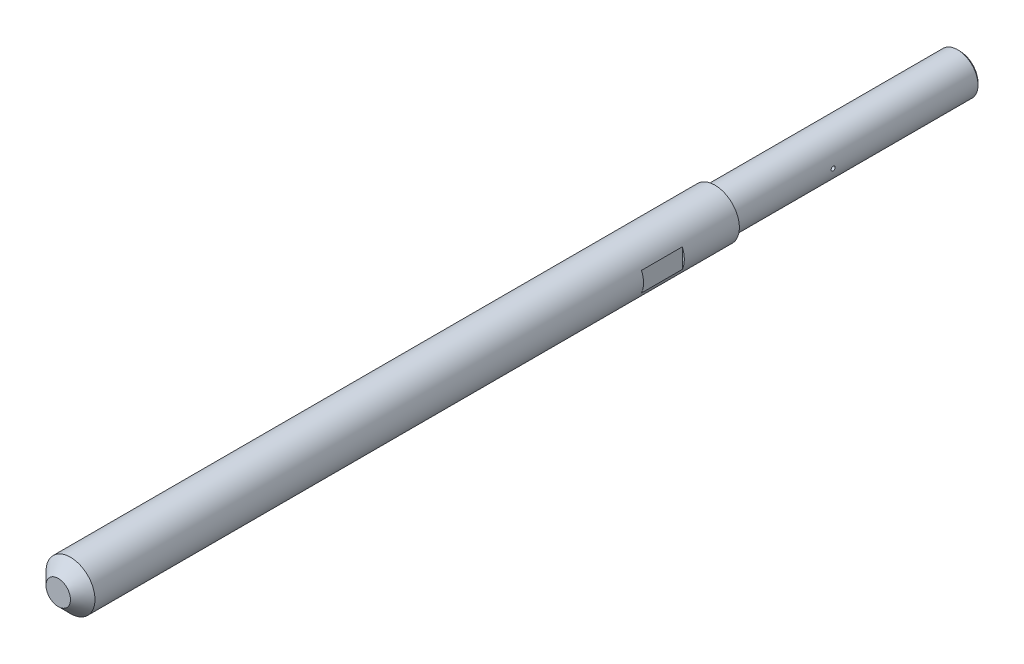
ISO-10303-21;
HEADER;
FILE_DESCRIPTION(('STEP AP214'),'2;1');
FILE_NAME('part.step','',(''),(''),'','','');
FILE_SCHEMA(('AUTOMOTIVE_DESIGN { 1 0 10303 214 1 1 1 1 }'));
ENDSEC;
DATA;
#1=APPLICATION_CONTEXT('core data for automotive mechanical design processes');
#2=APPLICATION_PROTOCOL_DEFINITION('international standard','automotive_design',2000,#1);
#3=PRODUCT_CONTEXT('',#1,'mechanical');
#4=PRODUCT('Part','Part','',(#3));
#5=PRODUCT_RELATED_PRODUCT_CATEGORY('part','',(#4));
#6=PRODUCT_DEFINITION_FORMATION('','',#4);
#7=PRODUCT_DEFINITION_CONTEXT('part definition',#1,'design');
#8=PRODUCT_DEFINITION('design','',#6,#7);
#9=PRODUCT_DEFINITION_SHAPE('','',#8);
#10=(LENGTH_UNIT() NAMED_UNIT(*) SI_UNIT(.MILLI.,.METRE.));
#11=(NAMED_UNIT(*) PLANE_ANGLE_UNIT() SI_UNIT($,.RADIAN.));
#12=(NAMED_UNIT(*) SI_UNIT($,.STERADIAN.) SOLID_ANGLE_UNIT());
#13=UNCERTAINTY_MEASURE_WITH_UNIT(LENGTH_MEASURE(1.E-05),#10,'distance_accuracy_value','');
#14=(GEOMETRIC_REPRESENTATION_CONTEXT(3) GLOBAL_UNCERTAINTY_ASSIGNED_CONTEXT((#13)) GLOBAL_UNIT_ASSIGNED_CONTEXT((#10,
#11,#12)) REPRESENTATION_CONTEXT('',''));
#15=CARTESIAN_POINT('',(0.,0.,0.));
#16=DIRECTION('',(0.,0.,1.));
#17=DIRECTION('',(1.,0.,0.));
#18=AXIS2_PLACEMENT_3D('',#15,#16,#17);
#19=CARTESIAN_POINT('',(0.,0.,221.));
#20=DIRECTION('',(0.,0.,-1.));
#21=DIRECTION('',(-1.,0.,0.));
#22=AXIS2_PLACEMENT_3D('',#19,#20,#21);
#23=CYLINDRICAL_SURFACE('',#22,6.);
#24=DIRECTION('',(0.,0.,-1.));
#25=VECTOR('',#24,1.);
#26=CARTESIAN_POINT('',(1.9891222716808,-5.66068834933557,221.));
#27=LINE('',#26,#25);
#28=CARTESIAN_POINT('',(1.9891222716808,-5.66068834933557,95.));
#29=VERTEX_POINT('',#28);
#30=CARTESIAN_POINT('',(1.9891222716808,-5.66068834933556,65.));
#31=VERTEX_POINT('',#30);
#32=EDGE_CURVE('E45',#29,#31,#27,.T.);
#33=ORIENTED_EDGE('',*,*,#32,.T.);
#34=CARTESIAN_POINT('',(0.,0.,65.));
#35=DIRECTION('',(0.,0.,-1.));
#36=DIRECTION('',(-1.,0.,0.));
#37=AXIS2_PLACEMENT_3D('',#34,#35,#36);
#38=CIRCLE('',#37,6.);
#39=CARTESIAN_POINT('',(-2.39791576165636,-5.5,65.));
#40=VERTEX_POINT('',#39);
#41=EDGE_CURVE('E11',#31,#40,#38,.T.);
#42=ORIENTED_EDGE('',*,*,#41,.T.);
#43=DIRECTION('',(0.,0.,-1.));
#44=VECTOR('',#43,1.);
#45=CARTESIAN_POINT('',(-2.39791576165636,-5.5,221.));
#46=LINE('',#45,#44);
#47=CARTESIAN_POINT('',(-2.39791576165636,-5.5,95.));
#48=VERTEX_POINT('',#47);
#49=EDGE_CURVE('E221',#40,#48,#46,.F.);
#50=ORIENTED_EDGE('',*,*,#49,.T.);
#51=CARTESIAN_POINT('',(0.,0.,95.));
#52=DIRECTION('',(0.,0.,1.));
#53=DIRECTION('',(1.,0.,0.));
#54=AXIS2_PLACEMENT_3D('',#51,#52,#53);
#55=CIRCLE('',#54,6.);
#56=EDGE_CURVE('E101',#48,#29,#55,.T.);
#57=ORIENTED_EDGE('',*,*,#56,.T.);
#58=EDGE_LOOP('',(#33,#42,#50,#57));
#59=FACE_BOUND('',#58,.T.);
#60=CARTESIAN_POINT('',(0.,0.,218.));
#61=DIRECTION('',(0.,0.,1.));
#62=DIRECTION('',(1.,0.,0.));
#63=AXIS2_PLACEMENT_3D('',#60,#61,#62);
#64=CIRCLE('',#63,6.);
#65=CARTESIAN_POINT('',(6.,0.,218.));
#66=VERTEX_POINT('',#65);
#67=EDGE_CURVE('E211',#66,#66,#64,.F.);
#68=ORIENTED_EDGE('',*,*,#67,.T.);
#69=EDGE_LOOP('',(#68));
#70=FACE_BOUND('',#69,.T.);
#71=CARTESIAN_POINT('',(0.,0.,60.));
#72=DIRECTION('',(0.,0.,1.));
#73=DIRECTION('',(1.,0.,0.));
#74=AXIS2_PLACEMENT_3D('',#71,#72,#73);
#75=CIRCLE('',#74,6.);
#76=CARTESIAN_POINT('',(6.,0.,60.));
#77=VERTEX_POINT('',#76);
#78=EDGE_CURVE('E121',#77,#77,#75,.T.);
#79=ORIENTED_EDGE('',*,*,#78,.T.);
#80=EDGE_LOOP('',(#79));
#81=FACE_BOUND('',#80,.T.);
#82=DIRECTION('',(0.,0.,-1.));
#83=VECTOR('',#82,1.);
#84=CARTESIAN_POINT('',(5.5,-2.39791576165636,221.));
#85=LINE('',#84,#83);
#86=CARTESIAN_POINT('',(5.5,-2.39791576165636,83.5));
#87=VERTEX_POINT('',#86);
#88=CARTESIAN_POINT('',(5.5,-2.39791576165636,73.5));
#89=VERTEX_POINT('',#88);
#90=EDGE_CURVE('E207',#87,#89,#85,.T.);
#91=ORIENTED_EDGE('',*,*,#90,.F.);
#92=CARTESIAN_POINT('',(0.,0.,83.5));
#93=DIRECTION('',(0.,0.,-1.));
#94=DIRECTION('',(-1.,0.,0.));
#95=AXIS2_PLACEMENT_3D('',#92,#93,#94);
#96=CIRCLE('',#95,6.);
#97=CARTESIAN_POINT('',(5.5,2.39791576165636,83.5));
#98=VERTEX_POINT('',#97);
#99=EDGE_CURVE('E201',#98,#87,#96,.T.);
#100=ORIENTED_EDGE('',*,*,#99,.F.);
#101=DIRECTION('',(0.,0.,-1.));
#102=VECTOR('',#101,1.);
#103=CARTESIAN_POINT('',(5.5,2.39791576165636,221.));
#104=LINE('',#103,#102);
#105=CARTESIAN_POINT('',(5.5,2.39791576165636,73.5));
#106=VERTEX_POINT('',#105);
#107=EDGE_CURVE('E128',#106,#98,#104,.F.);
#108=ORIENTED_EDGE('',*,*,#107,.F.);
#109=CARTESIAN_POINT('',(0.,0.,73.5));
#110=DIRECTION('',(0.,0.,1.));
#111=DIRECTION('',(1.,0.,0.));
#112=AXIS2_PLACEMENT_3D('',#109,#110,#111);
#113=CIRCLE('',#112,6.);
#114=EDGE_CURVE('E205',#89,#106,#113,.T.);
#115=ORIENTED_EDGE('',*,*,#114,.F.);
#116=EDGE_LOOP('',(#91,#100,#108,#115));
#117=FACE_BOUND('',#116,.T.);
#118=ADVANCED_FACE('F37',(#59,#70,#81,#117),#23,.T.);
#119=CARTESIAN_POINT('',(0.,0.,60.));
#120=DIRECTION('',(0.,0.,-1.));
#121=DIRECTION('',(-1.,0.,0.));
#122=AXIS2_PLACEMENT_3D('',#119,#120,#121);
#123=CYLINDRICAL_SURFACE('',#122,5.);
#124=CARTESIAN_POINT('',(0.,0.,0.49999999999998));
#125=DIRECTION('',(0.,0.,1.));
#126=DIRECTION('',(1.,0.,0.));
#127=AXIS2_PLACEMENT_3D('',#124,#125,#126);
#128=CIRCLE('',#127,5.);
#129=CARTESIAN_POINT('',(5.,0.,0.49999999999998));
#130=VERTEX_POINT('',#129);
#131=EDGE_CURVE('E217',#130,#130,#128,.T.);
#132=ORIENTED_EDGE('',*,*,#131,.T.);
#133=EDGE_LOOP('',(#132));
#134=FACE_BOUND('',#133,.T.);
#135=CARTESIAN_POINT('',(-5.,0.,36.5));
#136=CARTESIAN_POINT('',(-4.99999967760385,-0.0280101768957784,36.4999987870498));
#137=CARTESIAN_POINT('',(-4.99976212798103,-0.0560388725838859,36.4976383655518));
#138=CARTESIAN_POINT('',(-4.99883733797369,-0.111319199248418,36.4882578148548));
#139=CARTESIAN_POINT('',(-4.99814960217013,-0.138569939584413,36.4812325519877));
#140=CARTESIAN_POINT('',(-4.99640207281535,-0.191485837726707,36.4627288797011));
#141=CARTESIAN_POINT('',(-4.99534250400354,-0.217151942307455,36.4512531597408));
#142=CARTESIAN_POINT('',(-4.99296978697153,-0.266188080480203,36.4241795460342));
#143=CARTESIAN_POINT('',(-4.99165668919066,-0.289558569389538,36.4085824719999));
#144=CARTESIAN_POINT('',(-4.98891872170662,-0.33342977533704,36.3736486511689));
#145=CARTESIAN_POINT('',(-4.98749350786933,-0.353921072417444,36.354300100299));
#146=CARTESIAN_POINT('',(-4.98469478453131,-0.39137126071549,36.3124377328685));
#147=CARTESIAN_POINT('',(-4.98332127742458,-0.408329988541325,36.2899237699788));
#148=CARTESIAN_POINT('',(-4.98077795776392,-0.438266985221807,36.2423107341582));
#149=CARTESIAN_POINT('',(-4.97960858355453,-0.451236732727438,36.2172062779526));
#150=CARTESIAN_POINT('',(-4.97761018773262,-0.472773192371377,36.1651622070475));
#151=CARTESIAN_POINT('',(-4.97678115771111,-0.481340013295644,36.138222637708));
#152=CARTESIAN_POINT('',(-4.97556042036489,-0.493799520800946,36.083369099567));
#153=CARTESIAN_POINT('',(-4.97516725199048,-0.497707826501896,36.0554587115739));
#154=CARTESIAN_POINT('',(-4.97485821530263,-0.500787642567679,35.9993755683021));
#155=CARTESIAN_POINT('',(-4.97494233444373,-0.4999592774354,35.971202819939));
#156=CARTESIAN_POINT('',(-4.97557703449467,-0.49360214012634,35.9155023451533));
#157=CARTESIAN_POINT('',(-4.97612592295326,-0.488090422062276,35.8879726503356));
#158=CARTESIAN_POINT('',(-4.97762567143709,-0.472549572075293,35.8342310183994));
#159=CARTESIAN_POINT('',(-4.97857653689246,-0.462520379127873,35.8080190990875));
#160=CARTESIAN_POINT('',(-4.98077504726035,-0.438210446940754,35.7576032063506));
#161=CARTESIAN_POINT('',(-4.98202321954079,-0.423922141359989,35.7334029052553));
#162=CARTESIAN_POINT('',(-4.98467525866439,-0.391505013676613,35.6877373925441));
#163=CARTESIAN_POINT('',(-4.98607913006392,-0.373376079168252,35.6662722610091));
#164=CARTESIAN_POINT('',(-4.98889192656495,-0.333697056206034,35.6265873030055));
#165=CARTESIAN_POINT('',(-4.99030084666499,-0.31213223942568,35.6083821990596));
#166=CARTESIAN_POINT('',(-4.99295914539259,-0.266244740868554,35.5758481835448));
#167=CARTESIAN_POINT('',(-4.99420852384128,-0.241922055999798,35.5615192763218));
#168=CARTESIAN_POINT('',(-4.99640737833548,-0.19119905284618,35.5371449898449));
#169=CARTESIAN_POINT('',(-4.99735680207385,-0.16479837319495,35.527100357591));
#170=CARTESIAN_POINT('',(-4.99884823720704,-0.110673608664967,35.5115905416441));
#171=CARTESIAN_POINT('',(-4.99939026078532,-0.0829495633883018,35.5061252210047));
#172=CARTESIAN_POINT('',(-5.00000425834155,-0.0270925495459542,35.4999478461326));
#173=CARTESIAN_POINT('',(-5.00007824133868,0.00103815105274396,35.4992154758738));
#174=CARTESIAN_POINT('',(-4.99975320878398,0.0570218966578489,35.5024714315244));
#175=CARTESIAN_POINT('',(-4.99935419962234,0.0848749454102348,35.5064596936576));
#176=CARTESIAN_POINT('',(-4.99812930769597,0.139454103417337,35.5190268477108));
#177=CARTESIAN_POINT('',(-4.9973043095902,0.166182424486007,35.527596227239));
#178=CARTESIAN_POINT('',(-4.99531999430305,0.217822160691888,35.5490725870186));
#179=CARTESIAN_POINT('',(-4.99416066962627,0.242733535078557,35.5619796645197));
#180=CARTESIAN_POINT('',(-4.99163237665211,0.290124090086072,35.591815419332));
#181=CARTESIAN_POINT('',(-4.99026271801721,0.31259482987446,35.6087574444629));
#182=CARTESIAN_POINT('',(-4.9874696643476,0.35438081165594,35.6461630338705));
#183=CARTESIAN_POINT('',(-4.98604626796486,0.37369597442459,35.6666266865352));
#184=CARTESIAN_POINT('',(-4.98330012070377,0.408693054943575,35.7105832873295));
#185=CARTESIAN_POINT('',(-4.98197775069488,0.424361639339775,35.7340868782713));
#186=CARTESIAN_POINT('',(-4.97958916230445,0.451529129371915,35.7834036800733));
#187=CARTESIAN_POINT('',(-4.97852294042019,0.463028092026942,35.8092168593442));
#188=CARTESIAN_POINT('',(-4.97676973817025,0.481507604342238,35.8623743697329));
#189=CARTESIAN_POINT('',(-4.97608209224894,0.48849608740593,35.8897159200456));
#190=CARTESIAN_POINT('',(-4.97516182641438,0.49778200356473,35.9451915989804));
#191=CARTESIAN_POINT('',(-4.97492919345093,0.500079571199758,35.9733257048478));
#192=CARTESIAN_POINT('',(-4.97494556553781,0.499916569235627,36.0294553441784));
#193=CARTESIAN_POINT('',(-4.97519245043505,0.497476944796554,36.0574509414414));
#194=CARTESIAN_POINT('',(-4.97613551944773,0.487952726481823,36.1126324585842));
#195=CARTESIAN_POINT('',(-4.97683170406859,0.480868127381077,36.139818377553));
#196=CARTESIAN_POINT('',(-4.97859434131593,0.46226084314875,36.1926086745239));
#197=CARTESIAN_POINT('',(-4.9796607427018,0.450738772170456,36.2182132708149));
#198=CARTESIAN_POINT('',(-4.98204375919679,0.423585777455522,36.2671284458355));
#199=CARTESIAN_POINT('',(-4.98336037290475,0.40795487672771,36.2904390374103));
#200=CARTESIAN_POINT('',(-4.98610243604849,0.37294927814267,36.334211837236));
#201=CARTESIAN_POINT('',(-4.98752832363375,0.353558974445138,36.3546615381835));
#202=CARTESIAN_POINT('',(-4.99032427364392,0.311615849612557,36.3920261163498));
#203=CARTESIAN_POINT('',(-4.99169432261488,0.28906227205413,36.4089401456786));
#204=CARTESIAN_POINT('',(-4.99422781034581,0.241370717080645,36.4387867269273));
#205=CARTESIAN_POINT('',(-4.99539072013406,0.216226374673382,36.4517091454726));
#206=CARTESIAN_POINT('',(-4.99737314624948,0.164129139550275,36.4731312114119));
#207=CARTESIAN_POINT('',(-4.99819304954827,0.137178324912803,36.4816358454768));
#208=CARTESIAN_POINT('',(-4.99919106886867,0.0917291307028502,36.4918603085424));
#209=CARTESIAN_POINT('',(-4.99949300345916,0.0735212764222525,36.4949085221497));
#210=CARTESIAN_POINT('',(-4.99989757475393,0.0368782904086552,36.4989787630309));
#211=CARTESIAN_POINT('',(-5.00000021228012,0.0184431596132783,36.5000007986609));
#212=CARTESIAN_POINT('',(-5.,0.,36.5));
#213=B_SPLINE_CURVE_WITH_KNOTS('',3,(#135,#136,#137,#138,#139,#140,#141,#142,#143,#144,#145,
#146,#147,#148,#149,#150,#151,#152,#153,#154,#155,#156,#157,#158,#159,#160,#161,#162,#163,#164,
#165,#166,#167,#168,#169,#170,#171,#172,#173,#174,#175,#176,#177,#178,#179,#180,#181,#182,#183,
#184,#185,#186,#187,#188,#189,#190,#191,#192,#193,#194,#195,#196,#197,#198,#199,#200,#201,#202,
#203,#204,#205,#206,#207,#208,#209,#210,#211,#212),.UNSPECIFIED.,.T.,.F.,(4,2,2,2,2,2,2,2,2,2,2,
2,2,2,2,2,2,2,2,2,2,2,2,2,2,2,2,2,2,2,2,2,2,2,2,2,2,2,4),(0.,0.0839631831342365,
0.168018921417742,0.252023942866099,0.33601226879139,0.420269284311468,0.504530196103525,
0.588969877361109,0.673407472212513,0.757561160225978,0.841712636278873,0.925558987205551,
1.00940647080817,1.09340380686447,1.17740360165563,1.26177367098103,1.34614383489886,
1.43052870346791,1.51491104837719,1.59893094303879,1.68294970259571,1.76679467647152,
1.85064153024733,1.93476970374349,2.01889998905115,2.103333218043,2.18776529237687,
2.27204845296502,2.35632919619793,2.44023814646979,2.5241471911302,2.60804462681399,
2.69194159269479,2.77619458713825,2.86046776318478,2.94495315513121,3.02934297397647,
3.08462833616174,3.13991347034513),.UNSPECIFIED.);
#214=CARTESIAN_POINT('',(-5.,0.,36.5));
#215=VERTEX_POINT('',#214);
#216=EDGE_CURVE('E125',#215,#215,#213,.T.);
#217=ORIENTED_EDGE('',*,*,#216,.T.);
#218=EDGE_LOOP('',(#217));
#219=FACE_BOUND('',#218,.T.);
#220=CARTESIAN_POINT('',(5.,0.,35.5));
#221=CARTESIAN_POINT('',(4.99999967760385,-0.0280101768957784,35.5000012129502));
#222=CARTESIAN_POINT('',(4.99976212798103,-0.0560388725838859,35.5023616344482));
#223=CARTESIAN_POINT('',(4.99883733797369,-0.111319199248418,35.5117421851452));
#224=CARTESIAN_POINT('',(4.99814960217013,-0.138569939584413,35.5187674480123));
#225=CARTESIAN_POINT('',(4.99640207281535,-0.191485837726707,35.5372711202989));
#226=CARTESIAN_POINT('',(4.99534250400354,-0.217151942307455,35.5487468402592));
#227=CARTESIAN_POINT('',(4.99296978697153,-0.266188080480203,35.5758204539658));
#228=CARTESIAN_POINT('',(4.99165668919066,-0.289558569389538,35.5914175280001));
#229=CARTESIAN_POINT('',(4.98891872170662,-0.33342977533704,35.6263513488311));
#230=CARTESIAN_POINT('',(4.98749350786933,-0.353921072417444,35.645699899701));
#231=CARTESIAN_POINT('',(4.98469478453131,-0.39137126071549,35.6875622671315));
#232=CARTESIAN_POINT('',(4.98332127742458,-0.408329988541325,35.7100762300212));
#233=CARTESIAN_POINT('',(4.98077795776392,-0.438266985221807,35.7576892658418));
#234=CARTESIAN_POINT('',(4.97960858355453,-0.451236732727438,35.7827937220474));
#235=CARTESIAN_POINT('',(4.97761018773262,-0.472773192371377,35.8348377929525));
#236=CARTESIAN_POINT('',(4.97678115771111,-0.481340013295644,35.861777362292));
#237=CARTESIAN_POINT('',(4.97556042036489,-0.493799520800946,35.916630900433));
#238=CARTESIAN_POINT('',(4.97516725199048,-0.497707826501896,35.9445412884261));
#239=CARTESIAN_POINT('',(4.97485821530263,-0.500787642567679,36.0006244316979));
#240=CARTESIAN_POINT('',(4.97494233444373,-0.4999592774354,36.028797180061));
#241=CARTESIAN_POINT('',(4.97557703449467,-0.49360214012634,36.0844976548467));
#242=CARTESIAN_POINT('',(4.97612592295326,-0.488090422062276,36.1120273496643));
#243=CARTESIAN_POINT('',(4.97762567143709,-0.472549572075293,36.1657689816005));
#244=CARTESIAN_POINT('',(4.97857653689246,-0.462520379127873,36.1919809009125));
#245=CARTESIAN_POINT('',(4.98077504726035,-0.438210446940754,36.2423967936494));
#246=CARTESIAN_POINT('',(4.98202321954079,-0.423922141359989,36.2665970947447));
#247=CARTESIAN_POINT('',(4.98467525866439,-0.391505013676613,36.3122626074559));
#248=CARTESIAN_POINT('',(4.98607913006392,-0.373376079168252,36.3337277389909));
#249=CARTESIAN_POINT('',(4.98889192656495,-0.333697056206034,36.3734126969945));
#250=CARTESIAN_POINT('',(4.99030084666499,-0.31213223942568,36.3916178009404));
#251=CARTESIAN_POINT('',(4.99295914539259,-0.266244740868554,36.4241518164552));
#252=CARTESIAN_POINT('',(4.99420852384128,-0.241922055999798,36.4384807236782));
#253=CARTESIAN_POINT('',(4.99640737833548,-0.19119905284618,36.4628550101551));
#254=CARTESIAN_POINT('',(4.99735680207385,-0.16479837319495,36.472899642409));
#255=CARTESIAN_POINT('',(4.99884823720704,-0.110673608664967,36.4884094583559));
#256=CARTESIAN_POINT('',(4.99939026078532,-0.0829495633883018,36.4938747789953));
#257=CARTESIAN_POINT('',(5.00000425834155,-0.0270925495459542,36.5000521538674));
#258=CARTESIAN_POINT('',(5.00007824133868,0.00103815105274396,36.5007845241262));
#259=CARTESIAN_POINT('',(4.99975320878398,0.0570218966578489,36.4975285684756));
#260=CARTESIAN_POINT('',(4.99935419962234,0.0848749454102348,36.4935403063424));
#261=CARTESIAN_POINT('',(4.99812930769597,0.139454103417337,36.4809731522892));
#262=CARTESIAN_POINT('',(4.9973043095902,0.166182424486007,36.472403772761));
#263=CARTESIAN_POINT('',(4.99531999430305,0.217822160691888,36.4509274129814));
#264=CARTESIAN_POINT('',(4.99416066962627,0.242733535078557,36.4380203354803));
#265=CARTESIAN_POINT('',(4.99163237665211,0.290124090086072,36.408184580668));
#266=CARTESIAN_POINT('',(4.99026271801721,0.31259482987446,36.3912425555371));
#267=CARTESIAN_POINT('',(4.9874696643476,0.35438081165594,36.3538369661295));
#268=CARTESIAN_POINT('',(4.98604626796486,0.37369597442459,36.3333733134648));
#269=CARTESIAN_POINT('',(4.98330012070377,0.408693054943572,36.2894167126705));
#270=CARTESIAN_POINT('',(4.98197775069488,0.424361639339768,36.2659131217287));
#271=CARTESIAN_POINT('',(4.97958916230445,0.45152912937191,36.2165963199267));
#272=CARTESIAN_POINT('',(4.97852294042019,0.46302809202694,36.1907831406558));
#273=CARTESIAN_POINT('',(4.97676973817025,0.481507604342238,36.1376256302671));
#274=CARTESIAN_POINT('',(4.97608209224894,0.48849608740593,36.1102840799544));
#275=CARTESIAN_POINT('',(4.97516182641438,0.49778200356473,36.0548084010196));
#276=CARTESIAN_POINT('',(4.97492919345093,0.500079571199758,36.0266742951522));
#277=CARTESIAN_POINT('',(4.97494556553781,0.499916569235627,35.9705446558216));
#278=CARTESIAN_POINT('',(4.97519245043505,0.497476944796555,35.9425490585586));
#279=CARTESIAN_POINT('',(4.97613551944773,0.487952726481825,35.8873675414159));
#280=CARTESIAN_POINT('',(4.97683170406859,0.480868127381079,35.860181622447));
#281=CARTESIAN_POINT('',(4.97859434131593,0.46226084314875,35.8073913254761));
#282=CARTESIAN_POINT('',(4.9796607427018,0.450738772170456,35.7817867291851));
#283=CARTESIAN_POINT('',(4.98204375919679,0.423585777455522,35.7328715541645));
#284=CARTESIAN_POINT('',(4.98336037290475,0.40795487672771,35.7095609625897));
#285=CARTESIAN_POINT('',(4.98610243604849,0.37294927814267,35.665788162764));
#286=CARTESIAN_POINT('',(4.98752832363375,0.353558974445138,35.6453384618165));
#287=CARTESIAN_POINT('',(4.99032427364392,0.311615849612557,35.6079738836502));
#288=CARTESIAN_POINT('',(4.99169432261488,0.28906227205413,35.5910598543214));
#289=CARTESIAN_POINT('',(4.99422781034581,0.241370717080645,35.5612132730727));
#290=CARTESIAN_POINT('',(4.99539072013406,0.216226374673382,35.5482908545274));
#291=CARTESIAN_POINT('',(4.99737314624948,0.164129139550275,35.5268687885881));
#292=CARTESIAN_POINT('',(4.99819304954827,0.137178324912803,35.5183641545232));
#293=CARTESIAN_POINT('',(4.99919106886867,0.0917291307028507,35.5081396914576));
#294=CARTESIAN_POINT('',(4.99949300345916,0.0735212764222535,35.5050914778503));
#295=CARTESIAN_POINT('',(4.99989757475393,0.0368782904086562,35.5010212369691));
#296=CARTESIAN_POINT('',(5.00000021228012,0.0184431596132788,35.4999992013391));
#297=CARTESIAN_POINT('',(5.,0.,35.5));
#298=B_SPLINE_CURVE_WITH_KNOTS('',3,(#220,#221,#222,#223,#224,#225,#226,#227,#228,#229,#230,
#231,#232,#233,#234,#235,#236,#237,#238,#239,#240,#241,#242,#243,#244,#245,#246,#247,#248,#249,
#250,#251,#252,#253,#254,#255,#256,#257,#258,#259,#260,#261,#262,#263,#264,#265,#266,#267,#268,
#269,#270,#271,#272,#273,#274,#275,#276,#277,#278,#279,#280,#281,#282,#283,#284,#285,#286,#287,
#288,#289,#290,#291,#292,#293,#294,#295,#296,#297),.UNSPECIFIED.,.T.,.F.,(4,2,2,2,2,2,2,2,2,2,2,
2,2,2,2,2,2,2,2,2,2,2,2,2,2,2,2,2,2,2,2,2,2,2,2,2,2,2,4),(0.,0.0839631831342365,
0.168018921417742,0.252023942866099,0.33601226879139,0.420269284311468,0.504530196103525,
0.588969877361109,0.673407472212513,0.757561160225978,0.841712636278873,0.925558987205551,
1.00940647080817,1.09340380686447,1.17740360165563,1.26177367098103,1.34614383489886,
1.43052870346791,1.51491104837719,1.59893094303879,1.68294970259571,1.76679467647152,
1.85064153024733,1.93476970374349,2.01889998905115,2.10333321804298,2.18776529237687,
2.27204845296502,2.35632919619793,2.44023814646978,2.5241471911302,2.60804462681399,
2.69194159269479,2.77619458713825,2.86046776318478,2.94495315513121,3.02934297397647,
3.08462833616174,3.13991347034513),.UNSPECIFIED.);
#299=CARTESIAN_POINT('',(5.,0.,35.5));
#300=VERTEX_POINT('',#299);
#301=EDGE_CURVE('E120',#300,#300,#298,.T.);
#302=ORIENTED_EDGE('',*,*,#301,.T.);
#303=EDGE_LOOP('',(#302));
#304=FACE_BOUND('',#303,.T.);
#305=CARTESIAN_POINT('',(0.,0.,60.));
#306=DIRECTION('',(0.,0.,1.));
#307=DIRECTION('',(1.,0.,0.));
#308=AXIS2_PLACEMENT_3D('',#305,#306,#307);
#309=CIRCLE('',#308,5.);
#310=CARTESIAN_POINT('',(5.,0.,60.));
#311=VERTEX_POINT('',#310);
#312=EDGE_CURVE('E124',#311,#311,#309,.T.);
#313=ORIENTED_EDGE('',*,*,#312,.F.);
#314=EDGE_LOOP('',(#313));
#315=FACE_BOUND('',#314,.T.);
#316=ADVANCED_FACE('F138',(#134,#219,#304,#315),#123,.T.);
#317=CARTESIAN_POINT('',(0.,0.,0.));
#318=DIRECTION('',(0.,0.,1.));
#319=DIRECTION('',(1.,0.,0.));
#320=AXIS2_PLACEMENT_3D('',#317,#318,#319);
#321=PLANE('',#320);
#322=CARTESIAN_POINT('',(0.,0.,0.));
#323=DIRECTION('',(0.,0.,1.));
#324=DIRECTION('',(1.,0.,0.));
#325=AXIS2_PLACEMENT_3D('',#322,#323,#324);
#326=CIRCLE('',#325,4.50000000000003);
#327=CARTESIAN_POINT('',(4.50000000000003,0.,0.));
#328=VERTEX_POINT('',#327);
#329=EDGE_CURVE('E170',#328,#328,#326,.F.);
#330=ORIENTED_EDGE('',*,*,#329,.T.);
#331=EDGE_LOOP('',(#330));
#332=FACE_BOUND('',#331,.T.);
#333=CARTESIAN_POINT('',(0.,0.,0.));
#334=DIRECTION('',(0.,0.,-1.));
#335=DIRECTION('',(-1.,0.,0.));
#336=AXIS2_PLACEMENT_3D('',#333,#334,#335);
#337=CIRCLE('',#336,2.09999999999999);
#338=CARTESIAN_POINT('',(-2.09999999999999,0.,0.));
#339=VERTEX_POINT('',#338);
#340=EDGE_CURVE('E109',#339,#339,#337,.T.);
#341=ORIENTED_EDGE('',*,*,#340,.F.);
#342=EDGE_LOOP('',(#341));
#343=FACE_BOUND('',#342,.T.);
#344=ADVANCED_FACE('F154',(#332,#343),#321,.F.);
#345=CARTESIAN_POINT('',(0.,0.,221.));
#346=DIRECTION('',(0.,0.,1.));
#347=DIRECTION('',(1.,0.,0.));
#348=AXIS2_PLACEMENT_3D('',#345,#346,#347);
#349=PLANE('',#348);
#350=CARTESIAN_POINT('',(0.,0.,221.));
#351=DIRECTION('',(0.,0.,1.));
#352=DIRECTION('',(1.,0.,0.));
#353=AXIS2_PLACEMENT_3D('',#350,#351,#352);
#354=CIRCLE('',#353,2.99999999999998);
#355=CARTESIAN_POINT('',(2.99999999999998,0.,221.));
#356=VERTEX_POINT('',#355);
#357=EDGE_CURVE('E208',#356,#356,#354,.T.);
#358=ORIENTED_EDGE('',*,*,#357,.T.);
#359=EDGE_LOOP('',(#358));
#360=FACE_BOUND('',#359,.T.);
#361=ADVANCED_FACE('F150',(#360),#349,.T.);
#362=CARTESIAN_POINT('',(0.,0.,60.));
#363=DIRECTION('',(0.,0.,1.));
#364=DIRECTION('',(1.,0.,0.));
#365=AXIS2_PLACEMENT_3D('',#362,#363,#364);
#366=PLANE('',#365);
#367=ORIENTED_EDGE('',*,*,#312,.T.);
#368=EDGE_LOOP('',(#367));
#369=FACE_BOUND('',#368,.T.);
#370=ORIENTED_EDGE('',*,*,#78,.F.);
#371=EDGE_LOOP('',(#370));
#372=FACE_BOUND('',#371,.T.);
#373=ADVANCED_FACE('F147',(#369,#372),#366,.F.);
#374=CARTESIAN_POINT('',(-6.,0.,36.));
#375=DIRECTION('',(1.,0.,0.));
#376=DIRECTION('',(0.,0.,-1.));
#377=AXIS2_PLACEMENT_3D('',#374,#375,#376);
#378=CYLINDRICAL_SURFACE('',#377,0.499999999999999);
#379=ORIENTED_EDGE('',*,*,#301,.F.);
#380=EDGE_LOOP('',(#379));
#381=FACE_BOUND('',#380,.T.);
#382=ORIENTED_EDGE('',*,*,#216,.F.);
#383=EDGE_LOOP('',(#382));
#384=FACE_BOUND('',#383,.T.);
#385=ADVANCED_FACE('F141',(#381,#384),#378,.F.);
#386=CARTESIAN_POINT('',(6.,2.46807990622935,73.5));
#387=DIRECTION('',(0.,0.,1.));
#388=DIRECTION('',(1.,0.,0.));
#389=AXIS2_PLACEMENT_3D('',#386,#387,#388);
#390=PLANE('',#389);
#391=ORIENTED_EDGE('',*,*,#114,.T.);
#392=DIRECTION('',(0.,1.,0.));
#393=VECTOR('',#392,1.);
#394=CARTESIAN_POINT('',(5.5,2.46807990622935,73.5));
#395=LINE('',#394,#393);
#396=EDGE_CURVE('E60',#89,#106,#395,.T.);
#397=ORIENTED_EDGE('',*,*,#396,.F.);
#398=EDGE_LOOP('',(#391,#397));
#399=FACE_BOUND('',#398,.T.);
#400=ADVANCED_FACE('F146',(#399),#390,.T.);
#401=CARTESIAN_POINT('',(6.,2.46807990622935,83.5));
#402=DIRECTION('',(0.,0.,-1.));
#403=DIRECTION('',(-1.,0.,0.));
#404=AXIS2_PLACEMENT_3D('',#401,#402,#403);
#405=PLANE('',#404);
#406=ORIENTED_EDGE('',*,*,#99,.T.);
#407=DIRECTION('',(0.,-1.,0.));
#408=VECTOR('',#407,1.);
#409=CARTESIAN_POINT('',(5.5,2.46807990622935,83.5));
#410=LINE('',#409,#408);
#411=EDGE_CURVE('E117',#98,#87,#410,.T.);
#412=ORIENTED_EDGE('',*,*,#411,.F.);
#413=EDGE_LOOP('',(#406,#412));
#414=FACE_BOUND('',#413,.T.);
#415=ADVANCED_FACE('F192',(#414),#405,.T.);
#416=CARTESIAN_POINT('',(5.5,0.,0.));
#417=DIRECTION('',(1.,0.,0.));
#418=DIRECTION('',(0.,0.,-1.));
#419=AXIS2_PLACEMENT_3D('',#416,#417,#418);
#420=PLANE('',#419);
#421=ORIENTED_EDGE('',*,*,#90,.T.);
#422=ORIENTED_EDGE('',*,*,#396,.T.);
#423=ORIENTED_EDGE('',*,*,#107,.T.);
#424=ORIENTED_EDGE('',*,*,#411,.T.);
#425=EDGE_LOOP('',(#421,#422,#423,#424));
#426=FACE_BOUND('',#425,.T.);
#427=ADVANCED_FACE('F184',(#426),#420,.T.);
#428=CARTESIAN_POINT('',(0.,0.,10.));
#429=DIRECTION('',(0.,0.,-1.));
#430=DIRECTION('',(-1.,0.,0.));
#431=AXIS2_PLACEMENT_3D('',#428,#429,#430);
#432=CONICAL_SURFACE('',#431,2.1,1.02974425867665);
#433=CARTESIAN_POINT('',(0.,0.,11.2618072999579));
#434=VERTEX_POINT('',#433);
#435=VERTEX_LOOP('',#434);
#436=FACE_BOUND('',#435,.T.);
#437=CARTESIAN_POINT('',(0.,0.,10.));
#438=DIRECTION('',(0.,0.,-1.));
#439=DIRECTION('',(-1.,0.,0.));
#440=AXIS2_PLACEMENT_3D('',#437,#438,#439);
#441=CIRCLE('',#440,2.1);
#442=CARTESIAN_POINT('',(-2.1,0.,10.));
#443=VERTEX_POINT('',#442);
#444=EDGE_CURVE('E113',#443,#443,#441,.T.);
#445=ORIENTED_EDGE('',*,*,#444,.T.);
#446=EDGE_LOOP('',(#445));
#447=FACE_BOUND('',#446,.T.);
#448=ADVANCED_FACE('F176',(#436,#447),#432,.F.);
#449=CARTESIAN_POINT('',(0.,0.,0.));
#450=DIRECTION('',(0.,0.,-1.));
#451=DIRECTION('',(-1.,0.,0.));
#452=AXIS2_PLACEMENT_3D('',#449,#450,#451);
#453=CYLINDRICAL_SURFACE('',#452,2.09999999999999);
#454=ORIENTED_EDGE('',*,*,#444,.F.);
#455=EDGE_LOOP('',(#454));
#456=FACE_BOUND('',#455,.T.);
#457=ORIENTED_EDGE('',*,*,#340,.T.);
#458=EDGE_LOOP('',(#457));
#459=FACE_BOUND('',#458,.T.);
#460=ADVANCED_FACE('F173',(#456,#459),#453,.F.);
#461=CARTESIAN_POINT('',(0.,0.,221.));
#462=DIRECTION('',(0.,0.,-1.));
#463=DIRECTION('',(-1.,0.,0.));
#464=AXIS2_PLACEMENT_3D('',#461,#462,#463);
#465=CONICAL_SURFACE('',#464,2.99999999999998,0.785398163397443);
#466=ORIENTED_EDGE('',*,*,#67,.F.);
#467=EDGE_LOOP('',(#466));
#468=FACE_BOUND('',#467,.T.);
#469=ORIENTED_EDGE('',*,*,#357,.F.);
#470=EDGE_LOOP('',(#469));
#471=FACE_BOUND('',#470,.T.);
#472=ADVANCED_FACE('F175',(#468,#471),#465,.T.);
#473=CARTESIAN_POINT('',(0.,0.,0.49999999999998));
#474=DIRECTION('',(0.,0.,1.));
#475=DIRECTION('',(1.,0.,0.));
#476=AXIS2_PLACEMENT_3D('',#473,#474,#475);
#477=CONICAL_SURFACE('',#476,5.,0.785398163397437);
#478=ORIENTED_EDGE('',*,*,#329,.F.);
#479=EDGE_LOOP('',(#478));
#480=FACE_BOUND('',#479,.T.);
#481=ORIENTED_EDGE('',*,*,#131,.F.);
#482=EDGE_LOOP('',(#481));
#483=FACE_BOUND('',#482,.T.);
#484=ADVANCED_FACE('F39',(#480,#483),#477,.T.);
#485=CARTESIAN_POINT('',(1.9891222716808,-166.5,65.));
#486=DIRECTION('',(0.,0.,-1.));
#487=DIRECTION('',(-1.,0.,0.));
#488=AXIS2_PLACEMENT_3D('',#485,#486,#487);
#489=PLANE('',#488);
#490=DIRECTION('',(0.,1.,0.));
#491=VECTOR('',#490,1.);
#492=CARTESIAN_POINT('',(1.9891222716808,-166.5,65.));
#493=LINE('',#492,#491);
#494=CARTESIAN_POINT('',(1.9891222716808,-5.5,65.));
#495=VERTEX_POINT('',#494);
#496=EDGE_CURVE('E97',#31,#495,#493,.T.);
#497=ORIENTED_EDGE('',*,*,#496,.T.);
#498=DIRECTION('',(-1.,0.,0.));
#499=VECTOR('',#498,1.);
#500=CARTESIAN_POINT('',(1.9891222716808,-5.5,65.));
#501=LINE('',#500,#499);
#502=EDGE_CURVE('E98',#495,#40,#501,.T.);
#503=ORIENTED_EDGE('',*,*,#502,.T.);
#504=ORIENTED_EDGE('',*,*,#41,.F.);
#505=EDGE_LOOP('',(#497,#503,#504));
#506=FACE_BOUND('',#505,.T.);
#507=ADVANCED_FACE('F225',(#506),#489,.F.);
#508=CARTESIAN_POINT('',(1.9891222716808,-166.5,95.));
#509=DIRECTION('',(1.,0.,0.));
#510=DIRECTION('',(0.,0.,-1.));
#511=AXIS2_PLACEMENT_3D('',#508,#509,#510);
#512=PLANE('',#511);
#513=DIRECTION('',(0.,1.,0.));
#514=VECTOR('',#513,1.);
#515=CARTESIAN_POINT('',(1.9891222716808,-166.5,95.));
#516=LINE('',#515,#514);
#517=CARTESIAN_POINT('',(1.9891222716808,-5.5,95.));
#518=VERTEX_POINT('',#517);
#519=EDGE_CURVE('E89',#29,#518,#516,.T.);
#520=ORIENTED_EDGE('',*,*,#519,.T.);
#521=DIRECTION('',(0.,0.,-1.));
#522=VECTOR('',#521,1.);
#523=CARTESIAN_POINT('',(1.9891222716808,-5.5,95.));
#524=LINE('',#523,#522);
#525=EDGE_CURVE('E92',#518,#495,#524,.T.);
#526=ORIENTED_EDGE('',*,*,#525,.T.);
#527=ORIENTED_EDGE('',*,*,#496,.F.);
#528=ORIENTED_EDGE('',*,*,#32,.F.);
#529=EDGE_LOOP('',(#520,#526,#527,#528));
#530=FACE_BOUND('',#529,.T.);
#531=ADVANCED_FACE('F90',(#530),#512,.F.);
#532=CARTESIAN_POINT('',(1.9891222716808,-166.5,95.));
#533=DIRECTION('',(0.,0.,1.));
#534=DIRECTION('',(1.,0.,0.));
#535=AXIS2_PLACEMENT_3D('',#532,#533,#534);
#536=PLANE('',#535);
#537=DIRECTION('',(1.,0.,0.));
#538=VECTOR('',#537,1.);
#539=CARTESIAN_POINT('',(1.9891222716808,-5.5,95.));
#540=LINE('',#539,#538);
#541=EDGE_CURVE('E52',#48,#518,#540,.T.);
#542=ORIENTED_EDGE('',*,*,#541,.T.);
#543=ORIENTED_EDGE('',*,*,#519,.F.);
#544=ORIENTED_EDGE('',*,*,#56,.F.);
#545=EDGE_LOOP('',(#542,#543,#544));
#546=FACE_BOUND('',#545,.T.);
#547=ADVANCED_FACE('F100',(#546),#536,.F.);
#548=CARTESIAN_POINT('',(0.,-5.5,0.));
#549=DIRECTION('',(0.,1.,0.));
#550=DIRECTION('',(0.,0.,1.));
#551=AXIS2_PLACEMENT_3D('',#548,#549,#550);
#552=PLANE('',#551);
#553=ORIENTED_EDGE('',*,*,#502,.F.);
#554=ORIENTED_EDGE('',*,*,#525,.F.);
#555=ORIENTED_EDGE('',*,*,#541,.F.);
#556=ORIENTED_EDGE('',*,*,#49,.F.);
#557=EDGE_LOOP('',(#553,#554,#555,#556));
#558=FACE_BOUND('',#557,.T.);
#559=ADVANCED_FACE('F104',(#558),#552,.F.);
#560=CLOSED_SHELL('',(#118,#316,#344,#361,#373,#385,#400,#415,#427,#448,#460,#472,#484,#507,
#531,#547,#559));
#561=MANIFOLD_SOLID_BREP('B2',#560);
#562=ADVANCED_BREP_SHAPE_REPRESENTATION('',(#18,#561),#14);
#563=SHAPE_DEFINITION_REPRESENTATION(#9,#562);
ENDSEC;
END-ISO-10303-21;
